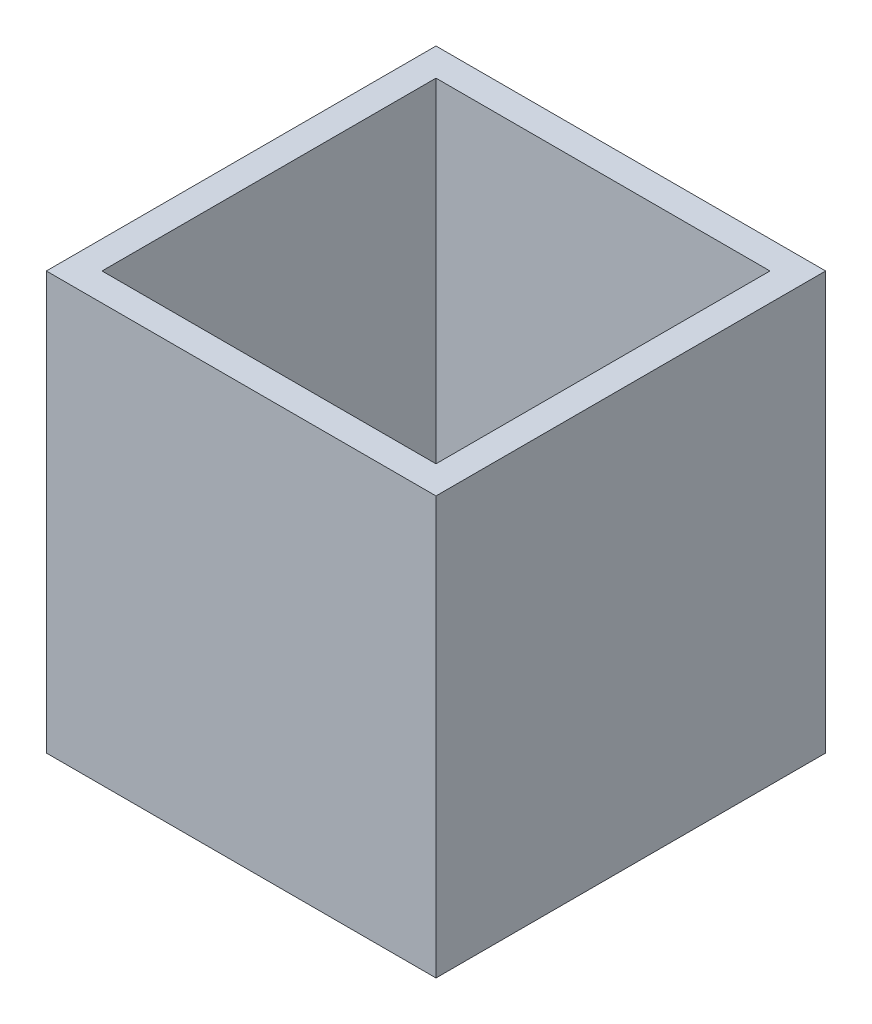
ISO-10303-21;
HEADER;
FILE_DESCRIPTION(('STEP AP214'),'2;1');
FILE_NAME('part.step','',(''),(''),'','','');
FILE_SCHEMA(('AUTOMOTIVE_DESIGN { 1 0 10303 214 1 1 1 1 }'));
ENDSEC;
DATA;
#1=APPLICATION_CONTEXT('core data for automotive mechanical design processes');
#2=APPLICATION_PROTOCOL_DEFINITION('international standard','automotive_design',2000,#1);
#3=PRODUCT_CONTEXT('',#1,'mechanical');
#4=PRODUCT('Part','Part','',(#3));
#5=PRODUCT_RELATED_PRODUCT_CATEGORY('part','',(#4));
#6=PRODUCT_DEFINITION_FORMATION('','',#4);
#7=PRODUCT_DEFINITION_CONTEXT('part definition',#1,'design');
#8=PRODUCT_DEFINITION('design','',#6,#7);
#9=PRODUCT_DEFINITION_SHAPE('','',#8);
#10=(LENGTH_UNIT() NAMED_UNIT(*) SI_UNIT(.MILLI.,.METRE.));
#11=(NAMED_UNIT(*) PLANE_ANGLE_UNIT() SI_UNIT($,.RADIAN.));
#12=(NAMED_UNIT(*) SI_UNIT($,.STERADIAN.) SOLID_ANGLE_UNIT());
#13=UNCERTAINTY_MEASURE_WITH_UNIT(LENGTH_MEASURE(1.E-05),#10,'distance_accuracy_value','');
#14=(GEOMETRIC_REPRESENTATION_CONTEXT(3) GLOBAL_UNCERTAINTY_ASSIGNED_CONTEXT((#13)) GLOBAL_UNIT_ASSIGNED_CONTEXT((#10,
#11,#12)) REPRESENTATION_CONTEXT('',''));
#15=CARTESIAN_POINT('',(0.,0.,0.));
#16=DIRECTION('',(0.,0.,1.));
#17=DIRECTION('',(1.,0.,0.));
#18=AXIS2_PLACEMENT_3D('',#15,#16,#17);
#19=CARTESIAN_POINT('',(0.,30.,0.));
#20=DIRECTION('',(0.,1.,0.));
#21=DIRECTION('',(0.,0.,1.));
#22=AXIS2_PLACEMENT_3D('',#19,#20,#21);
#23=PLANE('',#22);
#24=DIRECTION('',(0.,0.,-1.));
#25=VECTOR('',#24,1.);
#26=CARTESIAN_POINT('',(14.,30.,-14.));
#27=LINE('',#26,#25);
#28=CARTESIAN_POINT('',(14.,30.,14.));
#29=VERTEX_POINT('',#28);
#30=CARTESIAN_POINT('',(14.,30.,-14.));
#31=VERTEX_POINT('',#30);
#32=EDGE_CURVE('E162',#29,#31,#27,.T.);
#33=ORIENTED_EDGE('',*,*,#32,.T.);
#34=DIRECTION('',(-1.,0.,0.));
#35=VECTOR('',#34,1.);
#36=CARTESIAN_POINT('',(-14.,30.,-14.));
#37=LINE('',#36,#35);
#38=CARTESIAN_POINT('',(-14.,30.,-14.));
#39=VERTEX_POINT('',#38);
#40=EDGE_CURVE('E165',#31,#39,#37,.T.);
#41=ORIENTED_EDGE('',*,*,#40,.T.);
#42=DIRECTION('',(0.,0.,1.));
#43=VECTOR('',#42,1.);
#44=CARTESIAN_POINT('',(-14.,30.,-14.));
#45=LINE('',#44,#43);
#46=CARTESIAN_POINT('',(-14.,30.,14.));
#47=VERTEX_POINT('',#46);
#48=EDGE_CURVE('E168',#39,#47,#45,.T.);
#49=ORIENTED_EDGE('',*,*,#48,.T.);
#50=DIRECTION('',(1.,0.,0.));
#51=VECTOR('',#50,1.);
#52=CARTESIAN_POINT('',(-14.,30.,14.));
#53=LINE('',#52,#51);
#54=EDGE_CURVE('E170',#47,#29,#53,.T.);
#55=ORIENTED_EDGE('',*,*,#54,.T.);
#56=EDGE_LOOP('',(#33,#41,#49,#55));
#57=FACE_BOUND('',#56,.T.);
#58=DIRECTION('',(-1.,0.,0.));
#59=VECTOR('',#58,1.);
#60=CARTESIAN_POINT('',(-14.,30.,-12.));
#61=LINE('',#60,#59);
#62=CARTESIAN_POINT('',(12.,30.,-12.));
#63=VERTEX_POINT('',#62);
#64=CARTESIAN_POINT('',(-12.,30.,-12.));
#65=VERTEX_POINT('',#64);
#66=EDGE_CURVE('E134',#63,#65,#61,.T.);
#67=ORIENTED_EDGE('',*,*,#66,.F.);
#68=DIRECTION('',(0.,0.,-1.));
#69=VECTOR('',#68,1.);
#70=CARTESIAN_POINT('',(12.,30.,-14.));
#71=LINE('',#70,#69);
#72=CARTESIAN_POINT('',(12.,30.,12.));
#73=VERTEX_POINT('',#72);
#74=EDGE_CURVE('E126',#73,#63,#71,.T.);
#75=ORIENTED_EDGE('',*,*,#74,.F.);
#76=DIRECTION('',(1.,0.,0.));
#77=VECTOR('',#76,1.);
#78=CARTESIAN_POINT('',(-14.,30.,12.));
#79=LINE('',#78,#77);
#80=CARTESIAN_POINT('',(-12.,30.,12.));
#81=VERTEX_POINT('',#80);
#82=EDGE_CURVE('E148',#81,#73,#79,.T.);
#83=ORIENTED_EDGE('',*,*,#82,.F.);
#84=DIRECTION('',(0.,0.,1.));
#85=VECTOR('',#84,1.);
#86=CARTESIAN_POINT('',(-12.,30.,-14.));
#87=LINE('',#86,#85);
#88=EDGE_CURVE('E146',#65,#81,#87,.T.);
#89=ORIENTED_EDGE('',*,*,#88,.F.);
#90=EDGE_LOOP('',(#67,#75,#83,#89));
#91=FACE_BOUND('',#90,.T.);
#92=ADVANCED_FACE('F61',(#57,#91),#23,.T.);
#93=CARTESIAN_POINT('',(0.,0.,0.));
#94=DIRECTION('',(0.,1.,0.));
#95=DIRECTION('',(0.,0.,1.));
#96=AXIS2_PLACEMENT_3D('',#93,#94,#95);
#97=PLANE('',#96);
#98=DIRECTION('',(0.,0.,-1.));
#99=VECTOR('',#98,1.);
#100=CARTESIAN_POINT('',(14.,0.,-14.));
#101=LINE('',#100,#99);
#102=CARTESIAN_POINT('',(14.,0.,14.));
#103=VERTEX_POINT('',#102);
#104=CARTESIAN_POINT('',(14.,0.,-14.));
#105=VERTEX_POINT('',#104);
#106=EDGE_CURVE('E142',#103,#105,#101,.T.);
#107=ORIENTED_EDGE('',*,*,#106,.F.);
#108=DIRECTION('',(1.,0.,0.));
#109=VECTOR('',#108,1.);
#110=CARTESIAN_POINT('',(-14.,0.,14.));
#111=LINE('',#110,#109);
#112=CARTESIAN_POINT('',(-14.,0.,14.));
#113=VERTEX_POINT('',#112);
#114=EDGE_CURVE('E166',#113,#103,#111,.T.);
#115=ORIENTED_EDGE('',*,*,#114,.F.);
#116=DIRECTION('',(0.,0.,1.));
#117=VECTOR('',#116,1.);
#118=CARTESIAN_POINT('',(-14.,0.,-14.));
#119=LINE('',#118,#117);
#120=CARTESIAN_POINT('',(-14.,0.,-14.));
#121=VERTEX_POINT('',#120);
#122=EDGE_CURVE('E177',#121,#113,#119,.T.);
#123=ORIENTED_EDGE('',*,*,#122,.F.);
#124=DIRECTION('',(-1.,0.,0.));
#125=VECTOR('',#124,1.);
#126=CARTESIAN_POINT('',(-14.,0.,-14.));
#127=LINE('',#126,#125);
#128=EDGE_CURVE('E175',#105,#121,#127,.T.);
#129=ORIENTED_EDGE('',*,*,#128,.F.);
#130=EDGE_LOOP('',(#107,#115,#123,#129));
#131=FACE_BOUND('',#130,.T.);
#132=DIRECTION('',(0.,0.,-1.));
#133=VECTOR('',#132,1.);
#134=CARTESIAN_POINT('',(12.,0.,-14.));
#135=LINE('',#134,#133);
#136=CARTESIAN_POINT('',(12.,0.,12.));
#137=VERTEX_POINT('',#136);
#138=CARTESIAN_POINT('',(12.,0.,-12.));
#139=VERTEX_POINT('',#138);
#140=EDGE_CURVE('E84',#137,#139,#135,.T.);
#141=ORIENTED_EDGE('',*,*,#140,.T.);
#142=DIRECTION('',(-1.,0.,0.));
#143=VECTOR('',#142,1.);
#144=CARTESIAN_POINT('',(-14.,0.,-12.));
#145=LINE('',#144,#143);
#146=CARTESIAN_POINT('',(-12.,0.,-12.));
#147=VERTEX_POINT('',#146);
#148=EDGE_CURVE('E141',#139,#147,#145,.T.);
#149=ORIENTED_EDGE('',*,*,#148,.T.);
#150=DIRECTION('',(0.,0.,1.));
#151=VECTOR('',#150,1.);
#152=CARTESIAN_POINT('',(-12.,0.,-14.));
#153=LINE('',#152,#151);
#154=CARTESIAN_POINT('',(-12.,0.,12.));
#155=VERTEX_POINT('',#154);
#156=EDGE_CURVE('E154',#147,#155,#153,.T.);
#157=ORIENTED_EDGE('',*,*,#156,.T.);
#158=DIRECTION('',(1.,0.,0.));
#159=VECTOR('',#158,1.);
#160=CARTESIAN_POINT('',(-14.,0.,12.));
#161=LINE('',#160,#159);
#162=EDGE_CURVE('E135',#155,#137,#161,.T.);
#163=ORIENTED_EDGE('',*,*,#162,.T.);
#164=EDGE_LOOP('',(#141,#149,#157,#163));
#165=FACE_BOUND('',#164,.T.);
#166=ADVANCED_FACE('F195',(#131,#165),#97,.F.);
#167=CARTESIAN_POINT('',(14.,30.,-14.));
#168=DIRECTION('',(-1.,0.,0.));
#169=DIRECTION('',(0.,0.,1.));
#170=AXIS2_PLACEMENT_3D('',#167,#168,#169);
#171=PLANE('',#170);
#172=ORIENTED_EDGE('',*,*,#106,.T.);
#173=DIRECTION('',(0.,-1.,0.));
#174=VECTOR('',#173,1.);
#175=CARTESIAN_POINT('',(14.,30.,-14.));
#176=LINE('',#175,#174);
#177=EDGE_CURVE('E12',#31,#105,#176,.T.);
#178=ORIENTED_EDGE('',*,*,#177,.F.);
#179=ORIENTED_EDGE('',*,*,#32,.F.);
#180=DIRECTION('',(0.,-1.,0.));
#181=VECTOR('',#180,1.);
#182=CARTESIAN_POINT('',(14.,30.,14.));
#183=LINE('',#182,#181);
#184=EDGE_CURVE('E172',#29,#103,#183,.T.);
#185=ORIENTED_EDGE('',*,*,#184,.T.);
#186=EDGE_LOOP('',(#172,#178,#179,#185));
#187=FACE_BOUND('',#186,.T.);
#188=ADVANCED_FACE('F63',(#187),#171,.F.);
#189=CARTESIAN_POINT('',(-14.,30.,-14.));
#190=DIRECTION('',(0.,0.,1.));
#191=DIRECTION('',(1.,0.,0.));
#192=AXIS2_PLACEMENT_3D('',#189,#190,#191);
#193=PLANE('',#192);
#194=ORIENTED_EDGE('',*,*,#128,.T.);
#195=DIRECTION('',(0.,-1.,0.));
#196=VECTOR('',#195,1.);
#197=CARTESIAN_POINT('',(-14.,30.,-14.));
#198=LINE('',#197,#196);
#199=EDGE_CURVE('E69',#39,#121,#198,.T.);
#200=ORIENTED_EDGE('',*,*,#199,.F.);
#201=ORIENTED_EDGE('',*,*,#40,.F.);
#202=ORIENTED_EDGE('',*,*,#177,.T.);
#203=EDGE_LOOP('',(#194,#200,#201,#202));
#204=FACE_BOUND('',#203,.T.);
#205=ADVANCED_FACE('F205',(#204),#193,.F.);
#206=CARTESIAN_POINT('',(-14.,30.,-14.));
#207=DIRECTION('',(1.,0.,0.));
#208=DIRECTION('',(0.,0.,-1.));
#209=AXIS2_PLACEMENT_3D('',#206,#207,#208);
#210=PLANE('',#209);
#211=ORIENTED_EDGE('',*,*,#122,.T.);
#212=DIRECTION('',(0.,-1.,0.));
#213=VECTOR('',#212,1.);
#214=CARTESIAN_POINT('',(-14.,30.,14.));
#215=LINE('',#214,#213);
#216=EDGE_CURVE('E182',#47,#113,#215,.T.);
#217=ORIENTED_EDGE('',*,*,#216,.F.);
#218=ORIENTED_EDGE('',*,*,#48,.F.);
#219=ORIENTED_EDGE('',*,*,#199,.T.);
#220=EDGE_LOOP('',(#211,#217,#218,#219));
#221=FACE_BOUND('',#220,.T.);
#222=ADVANCED_FACE('F189',(#221),#210,.F.);
#223=CARTESIAN_POINT('',(-14.,30.,14.));
#224=DIRECTION('',(0.,0.,-1.));
#225=DIRECTION('',(-1.,0.,0.));
#226=AXIS2_PLACEMENT_3D('',#223,#224,#225);
#227=PLANE('',#226);
#228=ORIENTED_EDGE('',*,*,#114,.T.);
#229=ORIENTED_EDGE('',*,*,#184,.F.);
#230=ORIENTED_EDGE('',*,*,#54,.F.);
#231=ORIENTED_EDGE('',*,*,#216,.T.);
#232=EDGE_LOOP('',(#228,#229,#230,#231));
#233=FACE_BOUND('',#232,.T.);
#234=ADVANCED_FACE('F199',(#233),#227,.F.);
#235=CARTESIAN_POINT('',(12.,30.,-14.));
#236=DIRECTION('',(-1.,0.,0.));
#237=DIRECTION('',(0.,0.,1.));
#238=AXIS2_PLACEMENT_3D('',#235,#236,#237);
#239=PLANE('',#238);
#240=ORIENTED_EDGE('',*,*,#140,.F.);
#241=DIRECTION('',(0.,-1.,0.));
#242=VECTOR('',#241,1.);
#243=CARTESIAN_POINT('',(12.,30.,12.));
#244=LINE('',#243,#242);
#245=EDGE_CURVE('E130',#73,#137,#244,.T.);
#246=ORIENTED_EDGE('',*,*,#245,.F.);
#247=ORIENTED_EDGE('',*,*,#74,.T.);
#248=DIRECTION('',(0.,-1.,0.));
#249=VECTOR('',#248,1.);
#250=CARTESIAN_POINT('',(12.,30.,-12.));
#251=LINE('',#250,#249);
#252=EDGE_CURVE('E129',#63,#139,#251,.T.);
#253=ORIENTED_EDGE('',*,*,#252,.T.);
#254=EDGE_LOOP('',(#240,#246,#247,#253));
#255=FACE_BOUND('',#254,.T.);
#256=ADVANCED_FACE('F128',(#255),#239,.T.);
#257=CARTESIAN_POINT('',(-14.,30.,-12.));
#258=DIRECTION('',(0.,0.,1.));
#259=DIRECTION('',(1.,0.,0.));
#260=AXIS2_PLACEMENT_3D('',#257,#258,#259);
#261=PLANE('',#260);
#262=ORIENTED_EDGE('',*,*,#148,.F.);
#263=ORIENTED_EDGE('',*,*,#252,.F.);
#264=ORIENTED_EDGE('',*,*,#66,.T.);
#265=DIRECTION('',(0.,-1.,0.));
#266=VECTOR('',#265,1.);
#267=CARTESIAN_POINT('',(-12.,30.,-12.));
#268=LINE('',#267,#266);
#269=EDGE_CURVE('E143',#65,#147,#268,.T.);
#270=ORIENTED_EDGE('',*,*,#269,.T.);
#271=EDGE_LOOP('',(#262,#263,#264,#270));
#272=FACE_BOUND('',#271,.T.);
#273=ADVANCED_FACE('F138',(#272),#261,.T.);
#274=CARTESIAN_POINT('',(-12.,30.,-14.));
#275=DIRECTION('',(1.,0.,0.));
#276=DIRECTION('',(0.,0.,-1.));
#277=AXIS2_PLACEMENT_3D('',#274,#275,#276);
#278=PLANE('',#277);
#279=ORIENTED_EDGE('',*,*,#156,.F.);
#280=ORIENTED_EDGE('',*,*,#269,.F.);
#281=ORIENTED_EDGE('',*,*,#88,.T.);
#282=DIRECTION('',(0.,-1.,0.));
#283=VECTOR('',#282,1.);
#284=CARTESIAN_POINT('',(-12.,30.,12.));
#285=LINE('',#284,#283);
#286=EDGE_CURVE('E76',#81,#155,#285,.T.);
#287=ORIENTED_EDGE('',*,*,#286,.T.);
#288=EDGE_LOOP('',(#279,#280,#281,#287));
#289=FACE_BOUND('',#288,.T.);
#290=ADVANCED_FACE('F228',(#289),#278,.T.);
#291=CARTESIAN_POINT('',(-14.,30.,12.));
#292=DIRECTION('',(0.,0.,-1.));
#293=DIRECTION('',(-1.,0.,0.));
#294=AXIS2_PLACEMENT_3D('',#291,#292,#293);
#295=PLANE('',#294);
#296=ORIENTED_EDGE('',*,*,#162,.F.);
#297=ORIENTED_EDGE('',*,*,#286,.F.);
#298=ORIENTED_EDGE('',*,*,#82,.T.);
#299=ORIENTED_EDGE('',*,*,#245,.T.);
#300=EDGE_LOOP('',(#296,#297,#298,#299));
#301=FACE_BOUND('',#300,.T.);
#302=ADVANCED_FACE('F232',(#301),#295,.T.);
#303=CLOSED_SHELL('',(#92,#166,#188,#205,#222,#234,#256,#273,#290,#302));
#304=MANIFOLD_SOLID_BREP('B2',#303);
#305=ADVANCED_BREP_SHAPE_REPRESENTATION('',(#18,#304),#14);
#306=SHAPE_DEFINITION_REPRESENTATION(#9,#305);
ENDSEC;
END-ISO-10303-21;
